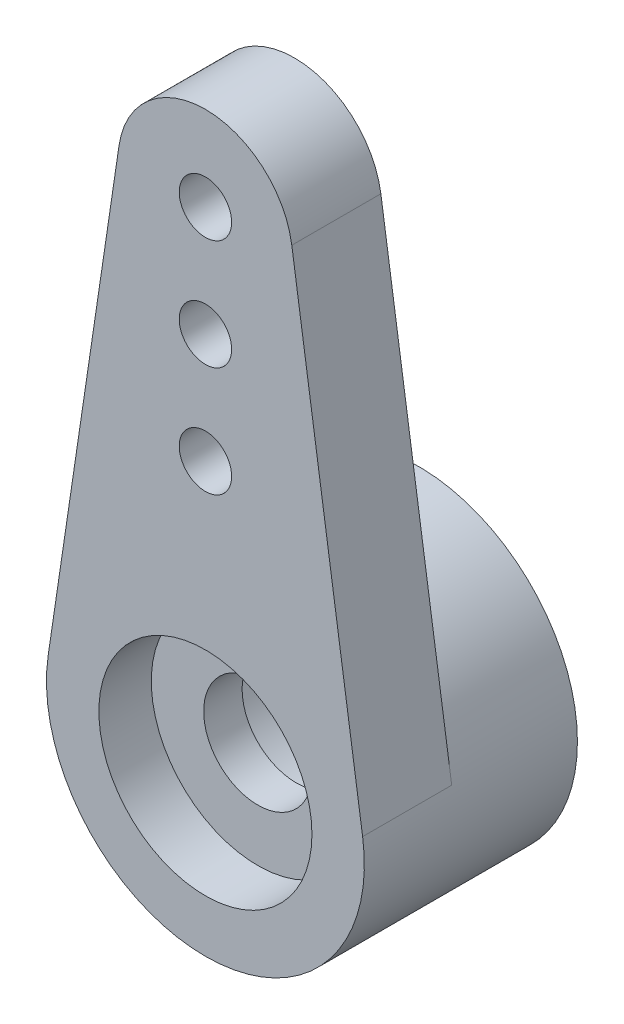
ISO-10303-21;
HEADER;
FILE_DESCRIPTION(('STEP AP214'),'2;1');
FILE_NAME('part.step','',(''),(''),'','','');
FILE_SCHEMA(('AUTOMOTIVE_DESIGN { 1 0 10303 214 1 1 1 1 }'));
ENDSEC;
DATA;
#1=APPLICATION_CONTEXT('core data for automotive mechanical design processes');
#2=APPLICATION_PROTOCOL_DEFINITION('international standard','automotive_design',2000,#1);
#3=PRODUCT_CONTEXT('',#1,'mechanical');
#4=PRODUCT('Part','Part','',(#3));
#5=PRODUCT_RELATED_PRODUCT_CATEGORY('part','',(#4));
#6=PRODUCT_DEFINITION_FORMATION('','',#4);
#7=PRODUCT_DEFINITION_CONTEXT('part definition',#1,'design');
#8=PRODUCT_DEFINITION('design','',#6,#7);
#9=PRODUCT_DEFINITION_SHAPE('','',#8);
#10=(LENGTH_UNIT() NAMED_UNIT(*) SI_UNIT(.MILLI.,.METRE.));
#11=(NAMED_UNIT(*) PLANE_ANGLE_UNIT() SI_UNIT($,.RADIAN.));
#12=(NAMED_UNIT(*) SI_UNIT($,.STERADIAN.) SOLID_ANGLE_UNIT());
#13=UNCERTAINTY_MEASURE_WITH_UNIT(LENGTH_MEASURE(1.E-05),#10,'distance_accuracy_value','');
#14=(GEOMETRIC_REPRESENTATION_CONTEXT(3) GLOBAL_UNCERTAINTY_ASSIGNED_CONTEXT((#13)) GLOBAL_UNIT_ASSIGNED_CONTEXT((#10,
#11,#12)) REPRESENTATION_CONTEXT('',''));
#15=CARTESIAN_POINT('',(0.,0.,0.));
#16=DIRECTION('',(0.,0.,1.));
#17=DIRECTION('',(1.,0.,0.));
#18=AXIS2_PLACEMENT_3D('',#15,#16,#17);
#19=CARTESIAN_POINT('',(0.,0.,1.05));
#20=DIRECTION('',(0.,0.,1.));
#21=DIRECTION('',(1.,0.,0.));
#22=AXIS2_PLACEMENT_3D('',#19,#20,#21);
#23=CYLINDRICAL_SURFACE('',#22,1.55);
#24=CARTESIAN_POINT('',(0.,0.,1.05));
#25=DIRECTION('',(0.,0.,1.));
#26=DIRECTION('',(1.,0.,0.));
#27=AXIS2_PLACEMENT_3D('',#24,#25,#26);
#28=CIRCLE('',#27,1.55);
#29=CARTESIAN_POINT('',(1.55,0.,1.05));
#30=VERTEX_POINT('',#29);
#31=EDGE_CURVE('E148',#30,#30,#28,.T.);
#32=ORIENTED_EDGE('',*,*,#31,.T.);
#33=EDGE_LOOP('',(#32));
#34=FACE_BOUND('',#33,.T.);
#35=CARTESIAN_POINT('',(0.,0.,-0.0499999999999997));
#36=DIRECTION('',(0.,0.,-1.));
#37=DIRECTION('',(-1.,0.,0.));
#38=AXIS2_PLACEMENT_3D('',#35,#36,#37);
#39=CIRCLE('',#38,1.55);
#40=CARTESIAN_POINT('',(-1.55,0.,-0.0499999999999997));
#41=VERTEX_POINT('',#40);
#42=EDGE_CURVE('E50',#41,#41,#39,.F.);
#43=ORIENTED_EDGE('',*,*,#42,.F.);
#44=EDGE_LOOP('',(#43));
#45=FACE_BOUND('',#44,.T.);
#46=ADVANCED_FACE('F43',(#34,#45),#23,.F.);
#47=CARTESIAN_POINT('',(0.,0.,0.));
#48=DIRECTION('',(0.,0.,1.));
#49=DIRECTION('',(1.,0.,0.));
#50=AXIS2_PLACEMENT_3D('',#47,#48,#49);
#51=PLANE('',#50);
#52=CARTESIAN_POINT('',(0.,14.025,0.));
#53=DIRECTION('',(0.,0.,1.));
#54=DIRECTION('',(1.,0.,0.));
#55=AXIS2_PLACEMENT_3D('',#52,#53,#54);
#56=CIRCLE('',#55,0.75);
#57=CARTESIAN_POINT('',(0.749999999999978,14.025,0.));
#58=VERTEX_POINT('',#57);
#59=EDGE_CURVE('E137',#58,#58,#56,.T.);
#60=ORIENTED_EDGE('',*,*,#59,.T.);
#61=EDGE_LOOP('',(#60));
#62=FACE_BOUND('',#61,.T.);
#63=CARTESIAN_POINT('',(0.,10.875,0.));
#64=DIRECTION('',(0.,0.,1.));
#65=DIRECTION('',(1.,0.,0.));
#66=AXIS2_PLACEMENT_3D('',#63,#64,#65);
#67=CIRCLE('',#66,0.75);
#68=CARTESIAN_POINT('',(0.749999999999989,10.875,0.));
#69=VERTEX_POINT('',#68);
#70=EDGE_CURVE('E128',#69,#69,#67,.T.);
#71=ORIENTED_EDGE('',*,*,#70,.T.);
#72=EDGE_LOOP('',(#71));
#73=FACE_BOUND('',#72,.T.);
#74=CARTESIAN_POINT('',(0.,7.725,0.));
#75=DIRECTION('',(0.,0.,1.));
#76=DIRECTION('',(1.,0.,0.));
#77=AXIS2_PLACEMENT_3D('',#74,#75,#76);
#78=CIRCLE('',#77,0.75);
#79=CARTESIAN_POINT('',(0.75,7.725,0.));
#80=VERTEX_POINT('',#79);
#81=EDGE_CURVE('E121',#80,#80,#78,.T.);
#82=ORIENTED_EDGE('',*,*,#81,.T.);
#83=EDGE_LOOP('',(#82));
#84=FACE_BOUND('',#83,.T.);
#85=CARTESIAN_POINT('',(0.,0.,0.));
#86=DIRECTION('',(0.,0.,-1.));
#87=DIRECTION('',(-1.,0.,0.));
#88=AXIS2_PLACEMENT_3D('',#85,#86,#87);
#89=CIRCLE('',#88,4.55);
#90=CARTESIAN_POINT('',(-4.50060254127625,0.66863799283154,0.));
#91=VERTEX_POINT('',#90);
#92=CARTESIAN_POINT('',(4.50060254127625,0.668637992831541,0.));
#93=VERTEX_POINT('',#92);
#94=EDGE_CURVE('E95',#91,#93,#89,.T.);
#95=ORIENTED_EDGE('',*,*,#94,.F.);
#96=DIRECTION('',(-0.146953405017921,-0.989143415665109,0.));
#97=VECTOR('',#96,1.);
#98=CARTESIAN_POINT('',(-4.50060254127625,0.66863799283154,0.));
#99=LINE('',#98,#97);
#100=CARTESIAN_POINT('',(-2.47285853916277,14.3173835125448,0.));
#101=VERTEX_POINT('',#100);
#102=EDGE_CURVE('E92',#101,#91,#99,.T.);
#103=ORIENTED_EDGE('',*,*,#102,.F.);
#104=CARTESIAN_POINT('',(0.,13.95,0.));
#105=DIRECTION('',(0.,0.,1.));
#106=DIRECTION('',(-1.,0.,0.));
#107=AXIS2_PLACEMENT_3D('',#104,#105,#106);
#108=CIRCLE('',#107,2.5);
#109=CARTESIAN_POINT('',(2.47285853916277,14.3173835125448,0.));
#110=VERTEX_POINT('',#109);
#111=EDGE_CURVE('E84',#110,#101,#108,.T.);
#112=ORIENTED_EDGE('',*,*,#111,.F.);
#113=DIRECTION('',(-0.146953405017921,0.989143415665109,0.));
#114=VECTOR('',#113,1.);
#115=CARTESIAN_POINT('',(4.50060254127625,0.668637992831541,0.));
#116=LINE('',#115,#114);
#117=EDGE_CURVE('E73',#93,#110,#116,.T.);
#118=ORIENTED_EDGE('',*,*,#117,.F.);
#119=EDGE_LOOP('',(#95,#103,#112,#118));
#120=FACE_BOUND('',#119,.T.);
#121=ADVANCED_FACE('F94',(#62,#73,#84,#120),#51,.F.);
#122=CARTESIAN_POINT('',(0.,0.,2.55));
#123=DIRECTION('',(0.,0.,1.));
#124=DIRECTION('',(1.,0.,0.));
#125=AXIS2_PLACEMENT_3D('',#122,#123,#124);
#126=PLANE('',#125);
#127=CARTESIAN_POINT('',(0.,0.,2.55));
#128=DIRECTION('',(0.,0.,1.));
#129=DIRECTION('',(1.,0.,0.));
#130=AXIS2_PLACEMENT_3D('',#127,#128,#129);
#131=CIRCLE('',#130,3.05);
#132=CARTESIAN_POINT('',(3.05,0.,2.55));
#133=VERTEX_POINT('',#132);
#134=EDGE_CURVE('E141',#133,#133,#131,.T.);
#135=ORIENTED_EDGE('',*,*,#134,.F.);
#136=EDGE_LOOP('',(#135));
#137=FACE_BOUND('',#136,.T.);
#138=CARTESIAN_POINT('',(0.,10.875,2.55));
#139=DIRECTION('',(0.,0.,1.));
#140=DIRECTION('',(1.,0.,0.));
#141=AXIS2_PLACEMENT_3D('',#138,#139,#140);
#142=CIRCLE('',#141,0.75);
#143=CARTESIAN_POINT('',(0.749999999999989,10.875,2.55));
#144=VERTEX_POINT('',#143);
#145=EDGE_CURVE('E130',#144,#144,#142,.T.);
#146=ORIENTED_EDGE('',*,*,#145,.F.);
#147=EDGE_LOOP('',(#146));
#148=FACE_BOUND('',#147,.T.);
#149=CARTESIAN_POINT('',(0.,0.,2.55));
#150=DIRECTION('',(0.,0.,1.));
#151=DIRECTION('',(1.,0.,0.));
#152=AXIS2_PLACEMENT_3D('',#149,#150,#151);
#153=CIRCLE('',#152,4.55);
#154=CARTESIAN_POINT('',(-4.50060254127625,0.66863799283154,2.55));
#155=VERTEX_POINT('',#154);
#156=CARTESIAN_POINT('',(4.50060254127625,0.668637992831541,2.55));
#157=VERTEX_POINT('',#156);
#158=EDGE_CURVE('E110',#155,#157,#153,.T.);
#159=ORIENTED_EDGE('',*,*,#158,.T.);
#160=DIRECTION('',(-0.146953405017921,0.989143415665109,0.));
#161=VECTOR('',#160,1.);
#162=CARTESIAN_POINT('',(4.50060254127625,0.668637992831541,2.55));
#163=LINE('',#162,#161);
#164=CARTESIAN_POINT('',(2.47285853916277,14.3173835125448,2.55));
#165=VERTEX_POINT('',#164);
#166=EDGE_CURVE('E87',#157,#165,#163,.T.);
#167=ORIENTED_EDGE('',*,*,#166,.T.);
#168=CARTESIAN_POINT('',(0.,13.95,2.55));
#169=DIRECTION('',(0.,0.,1.));
#170=DIRECTION('',(-1.,0.,0.));
#171=AXIS2_PLACEMENT_3D('',#168,#169,#170);
#172=CIRCLE('',#171,2.5);
#173=CARTESIAN_POINT('',(-2.47285853916277,14.3173835125448,2.55));
#174=VERTEX_POINT('',#173);
#175=EDGE_CURVE('E115',#165,#174,#172,.T.);
#176=ORIENTED_EDGE('',*,*,#175,.T.);
#177=DIRECTION('',(-0.146953405017921,-0.989143415665109,0.));
#178=VECTOR('',#177,1.);
#179=CARTESIAN_POINT('',(-4.50060254127625,0.66863799283154,2.55));
#180=LINE('',#179,#178);
#181=EDGE_CURVE('E62',#174,#155,#180,.T.);
#182=ORIENTED_EDGE('',*,*,#181,.T.);
#183=EDGE_LOOP('',(#159,#167,#176,#182));
#184=FACE_BOUND('',#183,.T.);
#185=CARTESIAN_POINT('',(0.,7.725,2.55));
#186=DIRECTION('',(0.,0.,1.));
#187=DIRECTION('',(1.,0.,0.));
#188=AXIS2_PLACEMENT_3D('',#185,#186,#187);
#189=CIRCLE('',#188,0.75);
#190=CARTESIAN_POINT('',(0.75,7.725,2.55));
#191=VERTEX_POINT('',#190);
#192=EDGE_CURVE('E119',#191,#191,#189,.T.);
#193=ORIENTED_EDGE('',*,*,#192,.F.);
#194=EDGE_LOOP('',(#193));
#195=FACE_BOUND('',#194,.T.);
#196=CARTESIAN_POINT('',(0.,14.025,2.55));
#197=DIRECTION('',(0.,0.,1.));
#198=DIRECTION('',(1.,0.,0.));
#199=AXIS2_PLACEMENT_3D('',#196,#197,#198);
#200=CIRCLE('',#199,0.75);
#201=CARTESIAN_POINT('',(0.749999999999978,14.025,2.55));
#202=VERTEX_POINT('',#201);
#203=EDGE_CURVE('E134',#202,#202,#200,.T.);
#204=ORIENTED_EDGE('',*,*,#203,.F.);
#205=EDGE_LOOP('',(#204));
#206=FACE_BOUND('',#205,.T.);
#207=ADVANCED_FACE('F172',(#137,#148,#184,#195,#206),#126,.T.);
#208=CARTESIAN_POINT('',(0.,0.,2.55));
#209=DIRECTION('',(0.,0.,-1.));
#210=DIRECTION('',(-1.,0.,0.));
#211=AXIS2_PLACEMENT_3D('',#208,#209,#210);
#212=CYLINDRICAL_SURFACE('',#211,4.55);
#213=DIRECTION('',(0.,0.,-1.));
#214=VECTOR('',#213,1.);
#215=CARTESIAN_POINT('',(-4.50060254127625,0.66863799283154,2.55));
#216=LINE('',#215,#214);
#217=EDGE_CURVE('E102',#155,#91,#216,.T.);
#218=ORIENTED_EDGE('',*,*,#217,.T.);
#219=ORIENTED_EDGE('',*,*,#94,.T.);
#220=DIRECTION('',(0.,0.,-1.));
#221=VECTOR('',#220,1.);
#222=CARTESIAN_POINT('',(4.50060254127625,0.668637992831541,2.55));
#223=LINE('',#222,#221);
#224=EDGE_CURVE('E12',#157,#93,#223,.T.);
#225=ORIENTED_EDGE('',*,*,#224,.F.);
#226=ORIENTED_EDGE('',*,*,#158,.F.);
#227=EDGE_LOOP('',(#218,#219,#225,#226));
#228=FACE_BOUND('',#227,.T.);
#229=CARTESIAN_POINT('',(0.,0.,-3.55));
#230=DIRECTION('',(0.,0.,1.));
#231=DIRECTION('',(1.,0.,0.));
#232=AXIS2_PLACEMENT_3D('',#229,#230,#231);
#233=CIRCLE('',#232,4.55);
#234=CARTESIAN_POINT('',(4.55,0.,-3.55));
#235=VERTEX_POINT('',#234);
#236=EDGE_CURVE('E97',#235,#235,#233,.T.);
#237=ORIENTED_EDGE('',*,*,#236,.T.);
#238=EDGE_LOOP('',(#237));
#239=FACE_BOUND('',#238,.T.);
#240=ADVANCED_FACE('F44',(#228,#239),#212,.T.);
#241=CARTESIAN_POINT('',(4.50060254127625,0.668637992831541,2.55));
#242=DIRECTION('',(-0.989143415665109,-0.146953405017921,0.));
#243=DIRECTION('',(0.146953405017921,-0.989143415665109,0.));
#244=AXIS2_PLACEMENT_3D('',#241,#242,#243);
#245=PLANE('',#244);
#246=ORIENTED_EDGE('',*,*,#117,.T.);
#247=DIRECTION('',(0.,0.,-1.));
#248=VECTOR('',#247,1.);
#249=CARTESIAN_POINT('',(2.47285853916277,14.3173835125448,2.55));
#250=LINE('',#249,#248);
#251=EDGE_CURVE('E52',#165,#110,#250,.T.);
#252=ORIENTED_EDGE('',*,*,#251,.F.);
#253=ORIENTED_EDGE('',*,*,#166,.F.);
#254=ORIENTED_EDGE('',*,*,#224,.T.);
#255=EDGE_LOOP('',(#246,#252,#253,#254));
#256=FACE_BOUND('',#255,.T.);
#257=ADVANCED_FACE('F206',(#256),#245,.F.);
#258=CARTESIAN_POINT('',(0.,13.95,2.55));
#259=DIRECTION('',(0.,0.,-1.));
#260=DIRECTION('',(-1.,0.,0.));
#261=AXIS2_PLACEMENT_3D('',#258,#259,#260);
#262=CYLINDRICAL_SURFACE('',#261,2.5);
#263=ORIENTED_EDGE('',*,*,#111,.T.);
#264=DIRECTION('',(0.,0.,-1.));
#265=VECTOR('',#264,1.);
#266=CARTESIAN_POINT('',(-2.47285853916277,14.3173835125448,2.55));
#267=LINE('',#266,#265);
#268=EDGE_CURVE('E106',#174,#101,#267,.T.);
#269=ORIENTED_EDGE('',*,*,#268,.F.);
#270=ORIENTED_EDGE('',*,*,#175,.F.);
#271=ORIENTED_EDGE('',*,*,#251,.T.);
#272=EDGE_LOOP('',(#263,#269,#270,#271));
#273=FACE_BOUND('',#272,.T.);
#274=ADVANCED_FACE('F120',(#273),#262,.T.);
#275=CARTESIAN_POINT('',(-4.50060254127625,0.66863799283154,2.55));
#276=DIRECTION('',(0.989143415665109,-0.146953405017921,0.));
#277=DIRECTION('',(0.146953405017921,0.989143415665109,0.));
#278=AXIS2_PLACEMENT_3D('',#275,#276,#277);
#279=PLANE('',#278);
#280=ORIENTED_EDGE('',*,*,#102,.T.);
#281=ORIENTED_EDGE('',*,*,#217,.F.);
#282=ORIENTED_EDGE('',*,*,#181,.F.);
#283=ORIENTED_EDGE('',*,*,#268,.T.);
#284=EDGE_LOOP('',(#280,#281,#282,#283));
#285=FACE_BOUND('',#284,.T.);
#286=ADVANCED_FACE('F103',(#285),#279,.F.);
#287=CARTESIAN_POINT('',(0.,7.725,2.55));
#288=DIRECTION('',(0.,0.,-1.));
#289=DIRECTION('',(-1.,0.,0.));
#290=AXIS2_PLACEMENT_3D('',#287,#288,#289);
#291=CYLINDRICAL_SURFACE('',#290,0.75);
#292=ORIENTED_EDGE('',*,*,#192,.T.);
#293=EDGE_LOOP('',(#292));
#294=FACE_BOUND('',#293,.T.);
#295=ORIENTED_EDGE('',*,*,#81,.F.);
#296=EDGE_LOOP('',(#295));
#297=FACE_BOUND('',#296,.T.);
#298=ADVANCED_FACE('F193',(#294,#297),#291,.F.);
#299=CARTESIAN_POINT('',(0.,10.875,2.55));
#300=DIRECTION('',(0.,0.,-1.));
#301=DIRECTION('',(-1.,0.,0.));
#302=AXIS2_PLACEMENT_3D('',#299,#300,#301);
#303=CYLINDRICAL_SURFACE('',#302,0.75);
#304=ORIENTED_EDGE('',*,*,#145,.T.);
#305=EDGE_LOOP('',(#304));
#306=FACE_BOUND('',#305,.T.);
#307=ORIENTED_EDGE('',*,*,#70,.F.);
#308=EDGE_LOOP('',(#307));
#309=FACE_BOUND('',#308,.T.);
#310=ADVANCED_FACE('F192',(#306,#309),#303,.F.);
#311=CARTESIAN_POINT('',(0.,14.025,2.55));
#312=DIRECTION('',(0.,0.,-1.));
#313=DIRECTION('',(-1.,0.,0.));
#314=AXIS2_PLACEMENT_3D('',#311,#312,#313);
#315=CYLINDRICAL_SURFACE('',#314,0.75);
#316=ORIENTED_EDGE('',*,*,#203,.T.);
#317=EDGE_LOOP('',(#316));
#318=FACE_BOUND('',#317,.T.);
#319=ORIENTED_EDGE('',*,*,#59,.F.);
#320=EDGE_LOOP('',(#319));
#321=FACE_BOUND('',#320,.T.);
#322=ADVANCED_FACE('F190',(#318,#321),#315,.F.);
#323=CARTESIAN_POINT('',(0.,0.,-3.55));
#324=DIRECTION('',(0.,0.,1.));
#325=DIRECTION('',(1.,0.,0.));
#326=AXIS2_PLACEMENT_3D('',#323,#324,#325);
#327=PLANE('',#326);
#328=CARTESIAN_POINT('',(0.,0.,-3.55));
#329=DIRECTION('',(0.,0.,-1.));
#330=DIRECTION('',(-1.,0.,0.));
#331=AXIS2_PLACEMENT_3D('',#328,#329,#330);
#332=CIRCLE('',#331,2.75);
#333=CARTESIAN_POINT('',(-2.75,0.,-3.55));
#334=VERTEX_POINT('',#333);
#335=EDGE_CURVE('E151',#334,#334,#332,.T.);
#336=ORIENTED_EDGE('',*,*,#335,.F.);
#337=EDGE_LOOP('',(#336));
#338=FACE_BOUND('',#337,.T.);
#339=ORIENTED_EDGE('',*,*,#236,.F.);
#340=EDGE_LOOP('',(#339));
#341=FACE_BOUND('',#340,.T.);
#342=ADVANCED_FACE('F184',(#338,#341),#327,.F.);
#343=CARTESIAN_POINT('',(0.,0.,1.05));
#344=DIRECTION('',(0.,0.,1.));
#345=DIRECTION('',(1.,0.,0.));
#346=AXIS2_PLACEMENT_3D('',#343,#344,#345);
#347=CYLINDRICAL_SURFACE('',#346,3.05);
#348=CARTESIAN_POINT('',(0.,0.,1.05));
#349=DIRECTION('',(0.,0.,1.));
#350=DIRECTION('',(1.,0.,0.));
#351=AXIS2_PLACEMENT_3D('',#348,#349,#350);
#352=CIRCLE('',#351,3.05);
#353=CARTESIAN_POINT('',(3.05,0.,1.05));
#354=VERTEX_POINT('',#353);
#355=EDGE_CURVE('E99',#354,#354,#352,.T.);
#356=ORIENTED_EDGE('',*,*,#355,.F.);
#357=EDGE_LOOP('',(#356));
#358=FACE_BOUND('',#357,.T.);
#359=ORIENTED_EDGE('',*,*,#134,.T.);
#360=EDGE_LOOP('',(#359));
#361=FACE_BOUND('',#360,.T.);
#362=ADVANCED_FACE('F178',(#358,#361),#347,.F.);
#363=CARTESIAN_POINT('',(0.,0.,1.05));
#364=DIRECTION('',(0.,0.,1.));
#365=DIRECTION('',(1.,0.,0.));
#366=AXIS2_PLACEMENT_3D('',#363,#364,#365);
#367=PLANE('',#366);
#368=ORIENTED_EDGE('',*,*,#31,.F.);
#369=EDGE_LOOP('',(#368));
#370=FACE_BOUND('',#369,.T.);
#371=ORIENTED_EDGE('',*,*,#355,.T.);
#372=EDGE_LOOP('',(#371));
#373=FACE_BOUND('',#372,.T.);
#374=ADVANCED_FACE('F180',(#370,#373),#367,.T.);
#375=CARTESIAN_POINT('',(0.,0.,-0.0499999999999997));
#376=DIRECTION('',(0.,0.,-1.));
#377=DIRECTION('',(-1.,0.,0.));
#378=AXIS2_PLACEMENT_3D('',#375,#376,#377);
#379=PLANE('',#378);
#380=CARTESIAN_POINT('',(0.,0.,-0.0499999999999997));
#381=DIRECTION('',(0.,0.,-1.));
#382=DIRECTION('',(-1.,0.,0.));
#383=AXIS2_PLACEMENT_3D('',#380,#381,#382);
#384=CIRCLE('',#383,2.75);
#385=CARTESIAN_POINT('',(-2.75,0.,-0.0499999999999997));
#386=VERTEX_POINT('',#385);
#387=EDGE_CURVE('E152',#386,#386,#384,.T.);
#388=ORIENTED_EDGE('',*,*,#387,.T.);
#389=EDGE_LOOP('',(#388));
#390=FACE_BOUND('',#389,.T.);
#391=ORIENTED_EDGE('',*,*,#42,.T.);
#392=EDGE_LOOP('',(#391));
#393=FACE_BOUND('',#392,.T.);
#394=ADVANCED_FACE('F161',(#390,#393),#379,.T.);
#395=CARTESIAN_POINT('',(0.,0.,-0.0499999999999997));
#396=DIRECTION('',(0.,0.,-1.));
#397=DIRECTION('',(-1.,0.,0.));
#398=AXIS2_PLACEMENT_3D('',#395,#396,#397);
#399=CYLINDRICAL_SURFACE('',#398,2.75);
#400=ORIENTED_EDGE('',*,*,#387,.F.);
#401=EDGE_LOOP('',(#400));
#402=FACE_BOUND('',#401,.T.);
#403=ORIENTED_EDGE('',*,*,#335,.T.);
#404=EDGE_LOOP('',(#403));
#405=FACE_BOUND('',#404,.T.);
#406=ADVANCED_FACE('F177',(#402,#405),#399,.F.);
#407=CLOSED_SHELL('',(#46,#121,#207,#240,#257,#274,#286,#298,#310,#322,#342,#362,#374,#394,#406));
#408=MANIFOLD_SOLID_BREP('B2',#407);
#409=ADVANCED_BREP_SHAPE_REPRESENTATION('',(#18,#408),#14);
#410=SHAPE_DEFINITION_REPRESENTATION(#9,#409);
ENDSEC;
END-ISO-10303-21;
